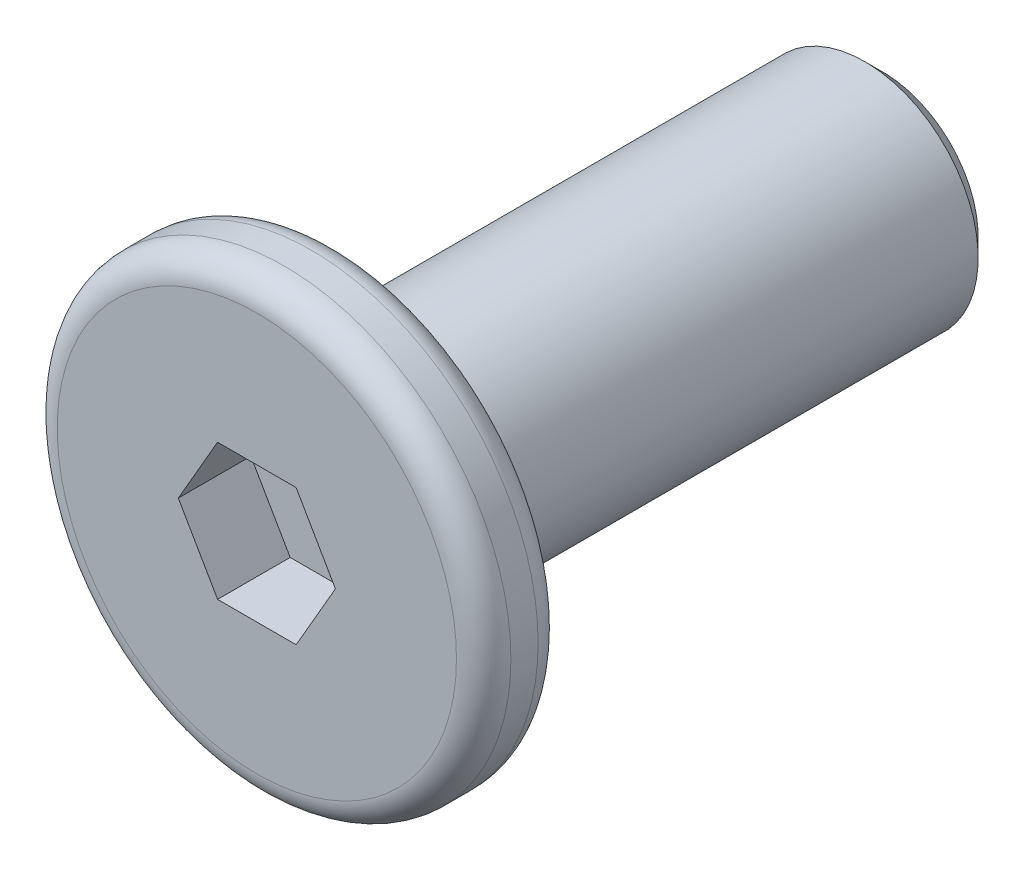
ISO-10303-21;
HEADER;
FILE_DESCRIPTION(('STEP AP214'),'2;1');
FILE_NAME('part.step','',(''),(''),'','','');
FILE_SCHEMA(('AUTOMOTIVE_DESIGN { 1 0 10303 214 1 1 1 1 }'));
ENDSEC;
DATA;
#1=APPLICATION_CONTEXT('core data for automotive mechanical design processes');
#2=APPLICATION_PROTOCOL_DEFINITION('international standard','automotive_design',2000,#1);
#3=PRODUCT_CONTEXT('',#1,'mechanical');
#4=PRODUCT('Part','Part','',(#3));
#5=PRODUCT_RELATED_PRODUCT_CATEGORY('part','',(#4));
#6=PRODUCT_DEFINITION_FORMATION('','',#4);
#7=PRODUCT_DEFINITION_CONTEXT('part definition',#1,'design');
#8=PRODUCT_DEFINITION('design','',#6,#7);
#9=PRODUCT_DEFINITION_SHAPE('','',#8);
#10=(LENGTH_UNIT() NAMED_UNIT(*) SI_UNIT(.MILLI.,.METRE.));
#11=(NAMED_UNIT(*) PLANE_ANGLE_UNIT() SI_UNIT($,.RADIAN.));
#12=(NAMED_UNIT(*) SI_UNIT($,.STERADIAN.) SOLID_ANGLE_UNIT());
#13=UNCERTAINTY_MEASURE_WITH_UNIT(LENGTH_MEASURE(1.E-05),#10,'distance_accuracy_value','');
#14=(GEOMETRIC_REPRESENTATION_CONTEXT(3) GLOBAL_UNCERTAINTY_ASSIGNED_CONTEXT((#13)) GLOBAL_UNIT_ASSIGNED_CONTEXT((#10,
#11,#12)) REPRESENTATION_CONTEXT('',''));
#15=CARTESIAN_POINT('',(0.,0.,0.));
#16=DIRECTION('',(0.,0.,1.));
#17=DIRECTION('',(1.,0.,0.));
#18=AXIS2_PLACEMENT_3D('',#15,#16,#17);
#19=CARTESIAN_POINT('',(0.,0.,0.45));
#20=DIRECTION('',(0.,0.,-1.));
#21=DIRECTION('',(-1.,0.,0.));
#22=AXIS2_PLACEMENT_3D('',#19,#20,#21);
#23=CYLINDRICAL_SURFACE('',#22,2.5);
#24=CARTESIAN_POINT('',(0.,0.,-0.15));
#25=DIRECTION('',(0.,0.,1.));
#26=DIRECTION('',(1.,0.,0.));
#27=AXIS2_PLACEMENT_3D('',#24,#25,#26);
#28=CIRCLE('',#27,2.5);
#29=CARTESIAN_POINT('',(2.5,0.,-0.15));
#30=VERTEX_POINT('',#29);
#31=EDGE_CURVE('E154',#30,#30,#28,.T.);
#32=ORIENTED_EDGE('',*,*,#31,.T.);
#33=EDGE_LOOP('',(#32));
#34=FACE_BOUND('',#33,.T.);
#35=CARTESIAN_POINT('',(0.,0.,0.15));
#36=DIRECTION('',(0.,0.,1.));
#37=DIRECTION('',(1.,0.,0.));
#38=AXIS2_PLACEMENT_3D('',#35,#36,#37);
#39=CIRCLE('',#38,2.5);
#40=CARTESIAN_POINT('',(2.5,0.,0.15));
#41=VERTEX_POINT('',#40);
#42=EDGE_CURVE('E151',#41,#41,#39,.F.);
#43=ORIENTED_EDGE('',*,*,#42,.T.);
#44=EDGE_LOOP('',(#43));
#45=FACE_BOUND('',#44,.T.);
#46=ADVANCED_FACE('F35',(#34,#45),#23,.T.);
#47=CARTESIAN_POINT('',(0.,0.,0.45));
#48=DIRECTION('',(0.,0.,1.));
#49=DIRECTION('',(1.,0.,0.));
#50=AXIS2_PLACEMENT_3D('',#47,#48,#49);
#51=PLANE('',#50);
#52=CARTESIAN_POINT('',(0.,0.,0.45));
#53=DIRECTION('',(0.,0.,1.));
#54=DIRECTION('',(1.,0.,0.));
#55=AXIS2_PLACEMENT_3D('',#52,#53,#54);
#56=CIRCLE('',#55,2.2);
#57=CARTESIAN_POINT('',(2.2,0.,0.45));
#58=VERTEX_POINT('',#57);
#59=EDGE_CURVE('E11',#58,#58,#56,.T.);
#60=ORIENTED_EDGE('',*,*,#59,.T.);
#61=EDGE_LOOP('',(#60));
#62=FACE_BOUND('',#61,.T.);
#63=DIRECTION('',(0.5,0.866025403784439,0.));
#64=VECTOR('',#63,1.);
#65=CARTESIAN_POINT('',(0.433012701892219,-0.75,0.45));
#66=LINE('',#65,#64);
#67=CARTESIAN_POINT('',(0.433012701892219,-0.75,0.45));
#68=VERTEX_POINT('',#67);
#69=CARTESIAN_POINT('',(0.866025403784439,0.,0.45));
#70=VERTEX_POINT('',#69);
#71=EDGE_CURVE('E50',#68,#70,#66,.T.);
#72=ORIENTED_EDGE('',*,*,#71,.F.);
#73=DIRECTION('',(1.,0.,0.));
#74=VECTOR('',#73,1.);
#75=CARTESIAN_POINT('',(-0.433012701892219,-0.75,0.45));
#76=LINE('',#75,#74);
#77=CARTESIAN_POINT('',(-0.433012701892219,-0.75,0.45));
#78=VERTEX_POINT('',#77);
#79=EDGE_CURVE('E133',#78,#68,#76,.T.);
#80=ORIENTED_EDGE('',*,*,#79,.F.);
#81=DIRECTION('',(0.500000000000001,-0.866025403784438,0.));
#82=VECTOR('',#81,1.);
#83=CARTESIAN_POINT('',(-0.866025403784439,0.,0.45));
#84=LINE('',#83,#82);
#85=CARTESIAN_POINT('',(-0.866025403784439,0.,0.45));
#86=VERTEX_POINT('',#85);
#87=EDGE_CURVE('E131',#86,#78,#84,.T.);
#88=ORIENTED_EDGE('',*,*,#87,.F.);
#89=DIRECTION('',(-0.5,-0.866025403784438,0.));
#90=VECTOR('',#89,1.);
#91=CARTESIAN_POINT('',(-0.433012701892219,0.75,0.45));
#92=LINE('',#91,#90);
#93=CARTESIAN_POINT('',(-0.433012701892219,0.75,0.45));
#94=VERTEX_POINT('',#93);
#95=EDGE_CURVE('E98',#94,#86,#92,.T.);
#96=ORIENTED_EDGE('',*,*,#95,.F.);
#97=DIRECTION('',(-1.,0.,0.));
#98=VECTOR('',#97,1.);
#99=CARTESIAN_POINT('',(0.433012701892219,0.75,0.45));
#100=LINE('',#99,#98);
#101=CARTESIAN_POINT('',(0.433012701892219,0.75,0.45));
#102=VERTEX_POINT('',#101);
#103=EDGE_CURVE('E127',#102,#94,#100,.T.);
#104=ORIENTED_EDGE('',*,*,#103,.F.);
#105=DIRECTION('',(-0.5,0.866025403784438,0.));
#106=VECTOR('',#105,1.);
#107=CARTESIAN_POINT('',(0.866025403784439,0.,0.45));
#108=LINE('',#107,#106);
#109=EDGE_CURVE('E124',#70,#102,#108,.T.);
#110=ORIENTED_EDGE('',*,*,#109,.F.);
#111=EDGE_LOOP('',(#72,#80,#88,#96,#104,#110));
#112=FACE_BOUND('',#111,.T.);
#113=ADVANCED_FACE('F169',(#62,#112),#51,.T.);
#114=CARTESIAN_POINT('',(0.,0.,-0.45));
#115=DIRECTION('',(0.,0.,1.));
#116=DIRECTION('',(1.,0.,0.));
#117=AXIS2_PLACEMENT_3D('',#114,#115,#116);
#118=PLANE('',#117);
#119=CARTESIAN_POINT('',(0.,0.,-0.45));
#120=DIRECTION('',(0.,0.,1.));
#121=DIRECTION('',(1.,0.,0.));
#122=AXIS2_PLACEMENT_3D('',#119,#120,#121);
#123=CIRCLE('',#122,2.2);
#124=CARTESIAN_POINT('',(2.2,0.,-0.45));
#125=VERTEX_POINT('',#124);
#126=EDGE_CURVE('E43',#125,#125,#123,.F.);
#127=ORIENTED_EDGE('',*,*,#126,.T.);
#128=EDGE_LOOP('',(#127));
#129=FACE_BOUND('',#128,.T.);
#130=CARTESIAN_POINT('',(0.,0.,-0.45));
#131=DIRECTION('',(0.,0.,-1.));
#132=DIRECTION('',(-1.,0.,0.));
#133=AXIS2_PLACEMENT_3D('',#130,#131,#132);
#134=CIRCLE('',#133,1.25);
#135=CARTESIAN_POINT('',(-1.25,0.,-0.45));
#136=VERTEX_POINT('',#135);
#137=EDGE_CURVE('E137',#136,#136,#134,.T.);
#138=ORIENTED_EDGE('',*,*,#137,.F.);
#139=EDGE_LOOP('',(#138));
#140=FACE_BOUND('',#139,.T.);
#141=ADVANCED_FACE('F159',(#129,#140),#118,.F.);
#142=CARTESIAN_POINT('',(0.,0.,-6.45));
#143=DIRECTION('',(0.,0.,1.));
#144=DIRECTION('',(1.,0.,0.));
#145=AXIS2_PLACEMENT_3D('',#142,#143,#144);
#146=CYLINDRICAL_SURFACE('',#145,1.25);
#147=CARTESIAN_POINT('',(0.,0.,-6.25));
#148=DIRECTION('',(0.,0.,-1.));
#149=DIRECTION('',(-1.,0.,0.));
#150=AXIS2_PLACEMENT_3D('',#147,#148,#149);
#151=CIRCLE('',#150,1.25);
#152=CARTESIAN_POINT('',(-1.25,0.,-6.25));
#153=VERTEX_POINT('',#152);
#154=EDGE_CURVE('E148',#153,#153,#151,.F.);
#155=ORIENTED_EDGE('',*,*,#154,.T.);
#156=EDGE_LOOP('',(#155));
#157=FACE_BOUND('',#156,.T.);
#158=ORIENTED_EDGE('',*,*,#137,.T.);
#159=EDGE_LOOP('',(#158));
#160=FACE_BOUND('',#159,.T.);
#161=ADVANCED_FACE('F204',(#157,#160),#146,.T.);
#162=CARTESIAN_POINT('',(0.,0.,-6.45));
#163=DIRECTION('',(0.,0.,-1.));
#164=DIRECTION('',(-1.,0.,0.));
#165=AXIS2_PLACEMENT_3D('',#162,#163,#164);
#166=PLANE('',#165);
#167=CARTESIAN_POINT('',(0.,0.,-6.45));
#168=DIRECTION('',(0.,0.,-1.));
#169=DIRECTION('',(-1.,0.,0.));
#170=AXIS2_PLACEMENT_3D('',#167,#168,#169);
#171=CIRCLE('',#170,1.05);
#172=CARTESIAN_POINT('',(-1.05,0.,-6.45));
#173=VERTEX_POINT('',#172);
#174=EDGE_CURVE('E145',#173,#173,#171,.T.);
#175=ORIENTED_EDGE('',*,*,#174,.T.);
#176=EDGE_LOOP('',(#175));
#177=FACE_BOUND('',#176,.T.);
#178=ADVANCED_FACE('F196',(#177),#166,.T.);
#179=CARTESIAN_POINT('',(0.,0.,-6.45));
#180=DIRECTION('',(0.,0.,1.));
#181=DIRECTION('',(1.,0.,0.));
#182=AXIS2_PLACEMENT_3D('',#179,#180,#181);
#183=CONICAL_SURFACE('',#182,1.05,0.785398163397448);
#184=ORIENTED_EDGE('',*,*,#154,.F.);
#185=EDGE_LOOP('',(#184));
#186=FACE_BOUND('',#185,.T.);
#187=ORIENTED_EDGE('',*,*,#174,.F.);
#188=EDGE_LOOP('',(#187));
#189=FACE_BOUND('',#188,.T.);
#190=ADVANCED_FACE('F189',(#186,#189),#183,.T.);
#191=CARTESIAN_POINT('',(0.433012701892219,-0.75,-0.35));
#192=DIRECTION('',(0.866025403784439,-0.5,0.));
#193=DIRECTION('',(0.5,0.866025403784439,0.));
#194=AXIS2_PLACEMENT_3D('',#191,#192,#193);
#195=PLANE('',#194);
#196=ORIENTED_EDGE('',*,*,#71,.T.);
#197=DIRECTION('',(0.,0.,1.));
#198=VECTOR('',#197,1.);
#199=CARTESIAN_POINT('',(0.866025403784439,0.,-0.35));
#200=LINE('',#199,#198);
#201=CARTESIAN_POINT('',(0.866025403784439,0.,-0.35));
#202=VERTEX_POINT('',#201);
#203=EDGE_CURVE('E80',#202,#70,#200,.T.);
#204=ORIENTED_EDGE('',*,*,#203,.F.);
#205=DIRECTION('',(0.5,0.866025403784439,0.));
#206=VECTOR('',#205,1.);
#207=CARTESIAN_POINT('',(0.433012701892219,-0.75,-0.35));
#208=LINE('',#207,#206);
#209=CARTESIAN_POINT('',(0.433012701892219,-0.75,-0.35));
#210=VERTEX_POINT('',#209);
#211=EDGE_CURVE('E135',#210,#202,#208,.T.);
#212=ORIENTED_EDGE('',*,*,#211,.F.);
#213=DIRECTION('',(0.,0.,1.));
#214=VECTOR('',#213,1.);
#215=CARTESIAN_POINT('',(0.433012701892219,-0.75,-0.35));
#216=LINE('',#215,#214);
#217=EDGE_CURVE('E58',#210,#68,#216,.T.);
#218=ORIENTED_EDGE('',*,*,#217,.T.);
#219=EDGE_LOOP('',(#196,#204,#212,#218));
#220=FACE_BOUND('',#219,.T.);
#221=ADVANCED_FACE('F186',(#220),#195,.F.);
#222=CARTESIAN_POINT('',(-0.433012701892219,-0.75,-0.35));
#223=DIRECTION('',(0.,-1.,0.));
#224=DIRECTION('',(0.,0.,-1.));
#225=AXIS2_PLACEMENT_3D('',#222,#223,#224);
#226=PLANE('',#225);
#227=ORIENTED_EDGE('',*,*,#79,.T.);
#228=ORIENTED_EDGE('',*,*,#217,.F.);
#229=DIRECTION('',(1.,0.,0.));
#230=VECTOR('',#229,1.);
#231=CARTESIAN_POINT('',(-0.433012701892219,-0.75,-0.35));
#232=LINE('',#231,#230);
#233=CARTESIAN_POINT('',(-0.433012701892219,-0.75,-0.35));
#234=VERTEX_POINT('',#233);
#235=EDGE_CURVE('E110',#234,#210,#232,.T.);
#236=ORIENTED_EDGE('',*,*,#235,.F.);
#237=DIRECTION('',(0.,0.,1.));
#238=VECTOR('',#237,1.);
#239=CARTESIAN_POINT('',(-0.433012701892219,-0.75,-0.35));
#240=LINE('',#239,#238);
#241=EDGE_CURVE('E102',#234,#78,#240,.T.);
#242=ORIENTED_EDGE('',*,*,#241,.T.);
#243=EDGE_LOOP('',(#227,#228,#236,#242));
#244=FACE_BOUND('',#243,.T.);
#245=ADVANCED_FACE('F188',(#244),#226,.F.);
#246=CARTESIAN_POINT('',(-0.866025403784439,0.,-0.35));
#247=DIRECTION('',(-0.866025403784438,-0.5,0.));
#248=DIRECTION('',(0.5,-0.866025403784438,0.));
#249=AXIS2_PLACEMENT_3D('',#246,#247,#248);
#250=PLANE('',#249);
#251=ORIENTED_EDGE('',*,*,#87,.T.);
#252=ORIENTED_EDGE('',*,*,#241,.F.);
#253=DIRECTION('',(0.500000000000001,-0.866025403784438,0.));
#254=VECTOR('',#253,1.);
#255=CARTESIAN_POINT('',(-0.866025403784439,0.,-0.35));
#256=LINE('',#255,#254);
#257=CARTESIAN_POINT('',(-0.866025403784439,0.,-0.35));
#258=VERTEX_POINT('',#257);
#259=EDGE_CURVE('E106',#258,#234,#256,.T.);
#260=ORIENTED_EDGE('',*,*,#259,.F.);
#261=DIRECTION('',(0.,0.,1.));
#262=VECTOR('',#261,1.);
#263=CARTESIAN_POINT('',(-0.866025403784439,0.,-0.35));
#264=LINE('',#263,#262);
#265=EDGE_CURVE('E91',#258,#86,#264,.T.);
#266=ORIENTED_EDGE('',*,*,#265,.T.);
#267=EDGE_LOOP('',(#251,#252,#260,#266));
#268=FACE_BOUND('',#267,.T.);
#269=ADVANCED_FACE('F107',(#268),#250,.F.);
#270=CARTESIAN_POINT('',(-0.433012701892219,0.75,-0.35));
#271=DIRECTION('',(-0.866025403784438,0.5,0.));
#272=DIRECTION('',(-0.5,-0.866025403784439,0.));
#273=AXIS2_PLACEMENT_3D('',#270,#271,#272);
#274=PLANE('',#273);
#275=ORIENTED_EDGE('',*,*,#95,.T.);
#276=ORIENTED_EDGE('',*,*,#265,.F.);
#277=DIRECTION('',(-0.5,-0.866025403784438,0.));
#278=VECTOR('',#277,1.);
#279=CARTESIAN_POINT('',(-0.433012701892219,0.75,-0.35));
#280=LINE('',#279,#278);
#281=CARTESIAN_POINT('',(-0.433012701892219,0.75,-0.35));
#282=VERTEX_POINT('',#281);
#283=EDGE_CURVE('E95',#282,#258,#280,.T.);
#284=ORIENTED_EDGE('',*,*,#283,.F.);
#285=DIRECTION('',(0.,0.,1.));
#286=VECTOR('',#285,1.);
#287=CARTESIAN_POINT('',(-0.433012701892219,0.75,-0.35));
#288=LINE('',#287,#286);
#289=EDGE_CURVE('E103',#282,#94,#288,.T.);
#290=ORIENTED_EDGE('',*,*,#289,.T.);
#291=EDGE_LOOP('',(#275,#276,#284,#290));
#292=FACE_BOUND('',#291,.T.);
#293=ADVANCED_FACE('F93',(#292),#274,.F.);
#294=CARTESIAN_POINT('',(0.433012701892219,0.75,-0.35));
#295=DIRECTION('',(0.,1.,0.));
#296=DIRECTION('',(-1.,0.,0.));
#297=AXIS2_PLACEMENT_3D('',#294,#295,#296);
#298=PLANE('',#297);
#299=ORIENTED_EDGE('',*,*,#103,.T.);
#300=ORIENTED_EDGE('',*,*,#289,.F.);
#301=DIRECTION('',(-1.,0.,0.));
#302=VECTOR('',#301,1.);
#303=CARTESIAN_POINT('',(0.433012701892219,0.75,-0.35));
#304=LINE('',#303,#302);
#305=CARTESIAN_POINT('',(0.433012701892219,0.75,-0.35));
#306=VERTEX_POINT('',#305);
#307=EDGE_CURVE('E116',#306,#282,#304,.T.);
#308=ORIENTED_EDGE('',*,*,#307,.F.);
#309=DIRECTION('',(0.,0.,1.));
#310=VECTOR('',#309,1.);
#311=CARTESIAN_POINT('',(0.433012701892219,0.75,-0.35));
#312=LINE('',#311,#310);
#313=EDGE_CURVE('E140',#306,#102,#312,.T.);
#314=ORIENTED_EDGE('',*,*,#313,.T.);
#315=EDGE_LOOP('',(#299,#300,#308,#314));
#316=FACE_BOUND('',#315,.T.);
#317=ADVANCED_FACE('F257',(#316),#298,.F.);
#318=CARTESIAN_POINT('',(0.866025403784439,0.,-0.35));
#319=DIRECTION('',(0.866025403784438,0.5,0.));
#320=DIRECTION('',(-0.5,0.866025403784438,0.));
#321=AXIS2_PLACEMENT_3D('',#318,#319,#320);
#322=PLANE('',#321);
#323=ORIENTED_EDGE('',*,*,#109,.T.);
#324=ORIENTED_EDGE('',*,*,#313,.F.);
#325=DIRECTION('',(-0.5,0.866025403784438,0.));
#326=VECTOR('',#325,1.);
#327=CARTESIAN_POINT('',(0.866025403784439,0.,-0.35));
#328=LINE('',#327,#326);
#329=EDGE_CURVE('E118',#202,#306,#328,.T.);
#330=ORIENTED_EDGE('',*,*,#329,.F.);
#331=ORIENTED_EDGE('',*,*,#203,.T.);
#332=EDGE_LOOP('',(#323,#324,#330,#331));
#333=FACE_BOUND('',#332,.T.);
#334=ADVANCED_FACE('F184',(#333),#322,.F.);
#335=CARTESIAN_POINT('',(0.,0.,-0.35));
#336=DIRECTION('',(0.,0.,1.));
#337=DIRECTION('',(1.,0.,0.));
#338=AXIS2_PLACEMENT_3D('',#335,#336,#337);
#339=PLANE('',#338);
#340=ORIENTED_EDGE('',*,*,#211,.T.);
#341=ORIENTED_EDGE('',*,*,#329,.T.);
#342=ORIENTED_EDGE('',*,*,#307,.T.);
#343=ORIENTED_EDGE('',*,*,#283,.T.);
#344=ORIENTED_EDGE('',*,*,#259,.T.);
#345=ORIENTED_EDGE('',*,*,#235,.T.);
#346=EDGE_LOOP('',(#340,#341,#342,#343,#344,#345));
#347=FACE_BOUND('',#346,.T.);
#348=ADVANCED_FACE('F113',(#347),#339,.T.);
#349=CARTESIAN_POINT('',(0.,0.,-0.15));
#350=DIRECTION('',(0.,0.,1.));
#351=DIRECTION('',(1.,0.,0.));
#352=AXIS2_PLACEMENT_3D('',#349,#350,#351);
#353=TOROIDAL_SURFACE('',#352,2.2,0.3);
#354=ORIENTED_EDGE('',*,*,#126,.F.);
#355=EDGE_LOOP('',(#354));
#356=FACE_BOUND('',#355,.T.);
#357=ORIENTED_EDGE('',*,*,#31,.F.);
#358=EDGE_LOOP('',(#357));
#359=FACE_BOUND('',#358,.T.);
#360=ADVANCED_FACE('F162',(#356,#359),#353,.T.);
#361=CARTESIAN_POINT('',(0.,0.,0.15));
#362=DIRECTION('',(0.,0.,1.));
#363=DIRECTION('',(1.,0.,0.));
#364=AXIS2_PLACEMENT_3D('',#361,#362,#363);
#365=TOROIDAL_SURFACE('',#364,2.2,0.3);
#366=ORIENTED_EDGE('',*,*,#42,.F.);
#367=EDGE_LOOP('',(#366));
#368=FACE_BOUND('',#367,.T.);
#369=ORIENTED_EDGE('',*,*,#59,.F.);
#370=EDGE_LOOP('',(#369));
#371=FACE_BOUND('',#370,.T.);
#372=ADVANCED_FACE('F37',(#368,#371),#365,.T.);
#373=CLOSED_SHELL('',(#46,#113,#141,#161,#178,#190,#221,#245,#269,#293,#317,#334,#348,#360,#372));
#374=MANIFOLD_SOLID_BREP('B2',#373);
#375=ADVANCED_BREP_SHAPE_REPRESENTATION('',(#18,#374),#14);
#376=SHAPE_DEFINITION_REPRESENTATION(#9,#375);
ENDSEC;
END-ISO-10303-21;
